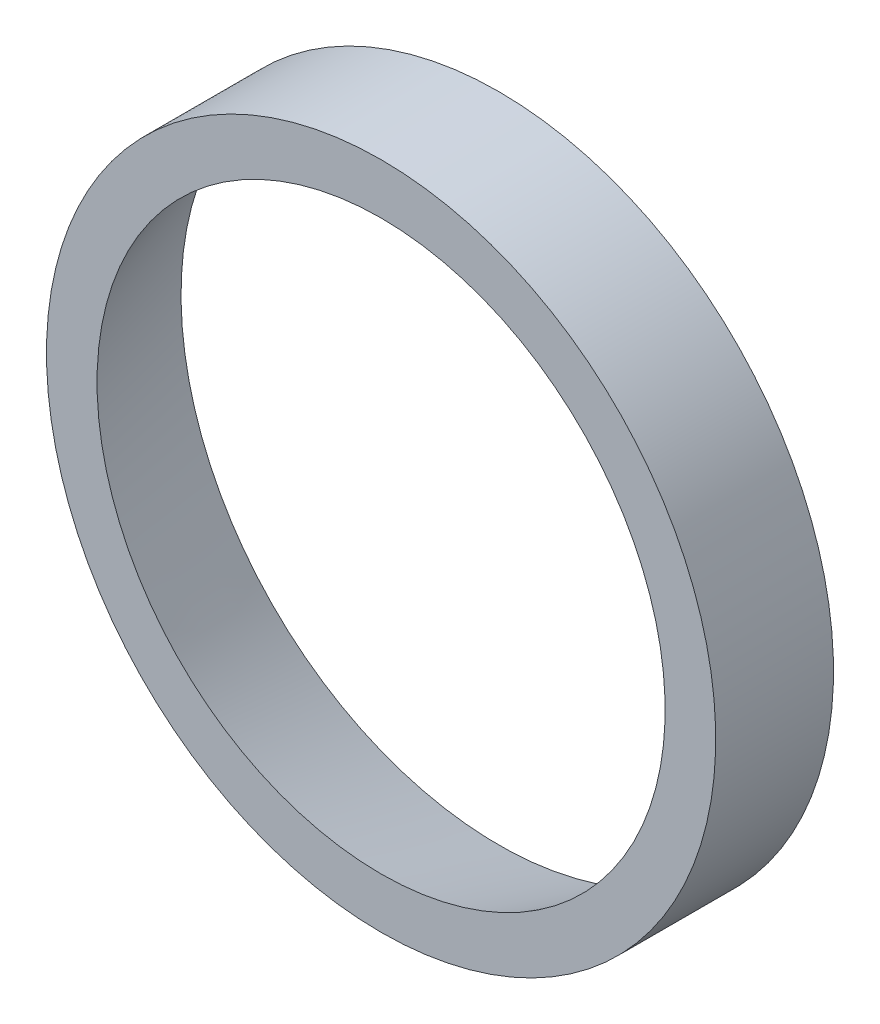
ISO-10303-21;
HEADER;
FILE_DESCRIPTION(('STEP AP214'),'2;1');
FILE_NAME('part.step','',(''),(''),'','','');
FILE_SCHEMA(('AUTOMOTIVE_DESIGN { 1 0 10303 214 1 1 1 1 }'));
ENDSEC;
DATA;
#1=APPLICATION_CONTEXT('core data for automotive mechanical design processes');
#2=APPLICATION_PROTOCOL_DEFINITION('international standard','automotive_design',2000,#1);
#3=PRODUCT_CONTEXT('',#1,'mechanical');
#4=PRODUCT('Part','Part','',(#3));
#5=PRODUCT_RELATED_PRODUCT_CATEGORY('part','',(#4));
#6=PRODUCT_DEFINITION_FORMATION('','',#4);
#7=PRODUCT_DEFINITION_CONTEXT('part definition',#1,'design');
#8=PRODUCT_DEFINITION('design','',#6,#7);
#9=PRODUCT_DEFINITION_SHAPE('','',#8);
#10=(LENGTH_UNIT() NAMED_UNIT(*) SI_UNIT(.MILLI.,.METRE.));
#11=(NAMED_UNIT(*) PLANE_ANGLE_UNIT() SI_UNIT($,.RADIAN.));
#12=(NAMED_UNIT(*) SI_UNIT($,.STERADIAN.) SOLID_ANGLE_UNIT());
#13=UNCERTAINTY_MEASURE_WITH_UNIT(LENGTH_MEASURE(1.E-05),#10,'distance_accuracy_value','');
#14=(GEOMETRIC_REPRESENTATION_CONTEXT(3) GLOBAL_UNCERTAINTY_ASSIGNED_CONTEXT((#13)) GLOBAL_UNIT_ASSIGNED_CONTEXT((#10,
#11,#12)) REPRESENTATION_CONTEXT('',''));
#15=CARTESIAN_POINT('',(0.,0.,0.));
#16=DIRECTION('',(0.,0.,1.));
#17=DIRECTION('',(1.,0.,0.));
#18=AXIS2_PLACEMENT_3D('',#15,#16,#17);
#19=CARTESIAN_POINT('',(0.,0.,18.));
#20=DIRECTION('',(0.,0.,-1.));
#21=DIRECTION('',(0.,1.,0.));
#22=AXIS2_PLACEMENT_3D('',#19,#20,#21);
#23=CONICAL_SURFACE('',#22,56.2133795217356,0.279636481311191);
#24=CARTESIAN_POINT('',(0.,0.,7.));
#25=DIRECTION('',(0.,0.,-1.));
#26=DIRECTION('',(0.,1.,0.));
#27=AXIS2_PLACEMENT_3D('',#24,#25,#26);
#28=CIRCLE('',#27,59.3721482087068);
#29=CARTESIAN_POINT('',(0.,59.3721482087068,7.));
#30=VERTEX_POINT('',#29);
#31=EDGE_CURVE('E46',#30,#30,#28,.T.);
#32=ORIENTED_EDGE('',*,*,#31,.T.);
#33=EDGE_LOOP('',(#32));
#34=FACE_BOUND('',#33,.T.);
#35=CARTESIAN_POINT('',(0.,0.,29.));
#36=DIRECTION('',(0.,0.,-1.));
#37=DIRECTION('',(0.,1.,0.));
#38=AXIS2_PLACEMENT_3D('',#35,#36,#37);
#39=CIRCLE('',#38,53.0546108347644);
#40=CARTESIAN_POINT('',(0.,53.0546108347644,29.));
#41=VERTEX_POINT('',#40);
#42=EDGE_CURVE('E11',#41,#41,#39,.T.);
#43=ORIENTED_EDGE('',*,*,#42,.F.);
#44=EDGE_LOOP('',(#43));
#45=FACE_BOUND('',#44,.T.);
#46=ADVANCED_FACE('F17',(#34,#45),#23,.F.);
#47=CARTESIAN_POINT('',(0.,57.7773054173822,29.));
#48=DIRECTION('',(0.,0.,1.));
#49=DIRECTION('',(1.,0.,0.));
#50=AXIS2_PLACEMENT_3D('',#47,#48,#49);
#51=PLANE('',#50);
#52=CARTESIAN_POINT('',(0.,0.,29.));
#53=DIRECTION('',(0.,0.,-1.));
#54=DIRECTION('',(0.,1.,0.));
#55=AXIS2_PLACEMENT_3D('',#52,#53,#54);
#56=CIRCLE('',#55,62.5);
#57=CARTESIAN_POINT('',(0.,62.5,29.));
#58=VERTEX_POINT('',#57);
#59=EDGE_CURVE('E21',#58,#58,#56,.T.);
#60=ORIENTED_EDGE('',*,*,#59,.F.);
#61=EDGE_LOOP('',(#60));
#62=FACE_BOUND('',#61,.T.);
#63=ORIENTED_EDGE('',*,*,#42,.T.);
#64=EDGE_LOOP('',(#63));
#65=FACE_BOUND('',#64,.T.);
#66=ADVANCED_FACE('F19',(#62,#65),#51,.T.);
#67=CARTESIAN_POINT('',(0.,0.,18.));
#68=DIRECTION('',(0.,0.,-1.));
#69=DIRECTION('',(0.,1.,0.));
#70=AXIS2_PLACEMENT_3D('',#67,#68,#69);
#71=CYLINDRICAL_SURFACE('',#70,62.5);
#72=CARTESIAN_POINT('',(0.,0.,7.));
#73=DIRECTION('',(0.,0.,-1.));
#74=DIRECTION('',(0.,1.,0.));
#75=AXIS2_PLACEMENT_3D('',#72,#73,#74);
#76=CIRCLE('',#75,62.5);
#77=CARTESIAN_POINT('',(0.,62.5,7.));
#78=VERTEX_POINT('',#77);
#79=EDGE_CURVE('E52',#78,#78,#76,.T.);
#80=ORIENTED_EDGE('',*,*,#79,.F.);
#81=EDGE_LOOP('',(#80));
#82=FACE_BOUND('',#81,.T.);
#83=ORIENTED_EDGE('',*,*,#59,.T.);
#84=EDGE_LOOP('',(#83));
#85=FACE_BOUND('',#84,.T.);
#86=ADVANCED_FACE('F69',(#82,#85),#71,.T.);
#87=CARTESIAN_POINT('',(0.,60.9360741043534,7.));
#88=DIRECTION('',(0.,0.,-1.));
#89=DIRECTION('',(0.,-1.,0.));
#90=AXIS2_PLACEMENT_3D('',#87,#88,#89);
#91=PLANE('',#90);
#92=ORIENTED_EDGE('',*,*,#79,.T.);
#93=EDGE_LOOP('',(#92));
#94=FACE_BOUND('',#93,.T.);
#95=ORIENTED_EDGE('',*,*,#31,.F.);
#96=EDGE_LOOP('',(#95));
#97=FACE_BOUND('',#96,.T.);
#98=ADVANCED_FACE('F53',(#94,#97),#91,.T.);
#99=CLOSED_SHELL('',(#46,#66,#86,#98));
#100=MANIFOLD_SOLID_BREP('B1',#99);
#101=ADVANCED_BREP_SHAPE_REPRESENTATION('',(#18,#100),#14);
#102=SHAPE_DEFINITION_REPRESENTATION(#9,#101);
ENDSEC;
END-ISO-10303-21;
